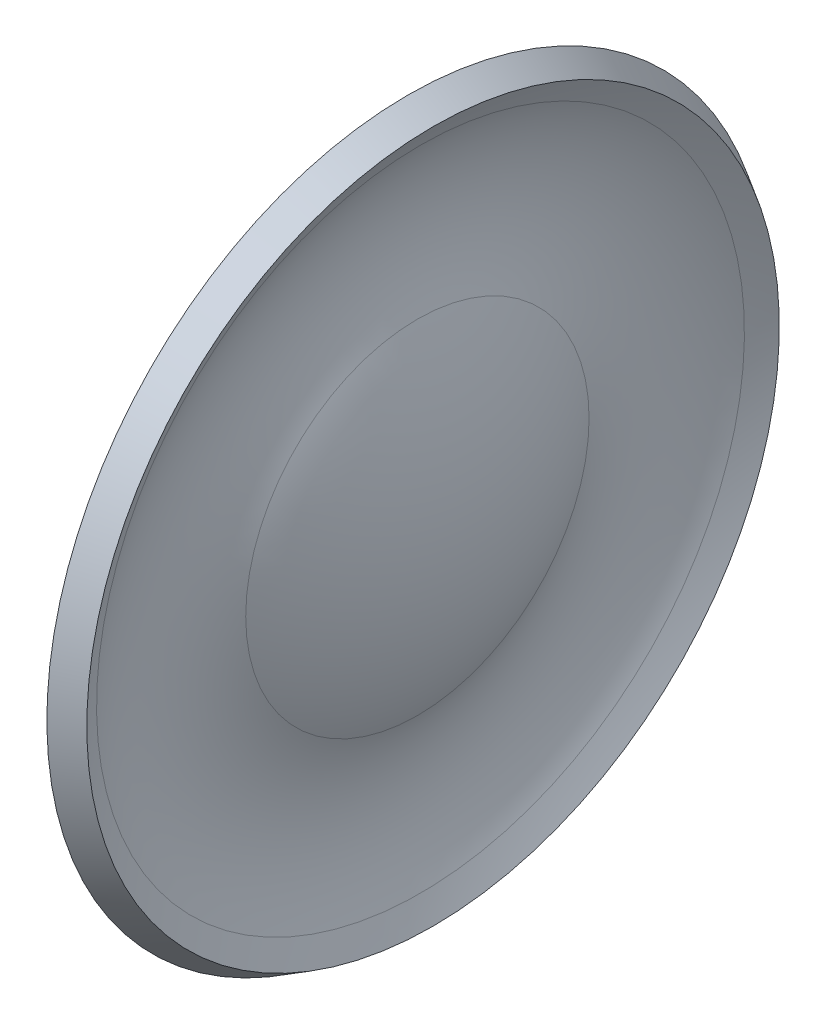
ISO-10303-21;
HEADER;
FILE_DESCRIPTION(('STEP AP214'),'2;1');
FILE_NAME('part.step','',(''),(''),'','','');
FILE_SCHEMA(('AUTOMOTIVE_DESIGN { 1 0 10303 214 1 1 1 1 }'));
ENDSEC;
DATA;
#1=APPLICATION_CONTEXT('core data for automotive mechanical design processes');
#2=APPLICATION_PROTOCOL_DEFINITION('international standard','automotive_design',2000,#1);
#3=PRODUCT_CONTEXT('',#1,'mechanical');
#4=PRODUCT('Part','Part','',(#3));
#5=PRODUCT_RELATED_PRODUCT_CATEGORY('part','',(#4));
#6=PRODUCT_DEFINITION_FORMATION('','',#4);
#7=PRODUCT_DEFINITION_CONTEXT('part definition',#1,'design');
#8=PRODUCT_DEFINITION('design','',#6,#7);
#9=PRODUCT_DEFINITION_SHAPE('','',#8);
#10=(LENGTH_UNIT() NAMED_UNIT(*) SI_UNIT(.MILLI.,.METRE.));
#11=(NAMED_UNIT(*) PLANE_ANGLE_UNIT() SI_UNIT($,.RADIAN.));
#12=(NAMED_UNIT(*) SI_UNIT($,.STERADIAN.) SOLID_ANGLE_UNIT());
#13=UNCERTAINTY_MEASURE_WITH_UNIT(LENGTH_MEASURE(1.E-05),#10,'distance_accuracy_value','');
#14=(GEOMETRIC_REPRESENTATION_CONTEXT(3) GLOBAL_UNCERTAINTY_ASSIGNED_CONTEXT((#13)) GLOBAL_UNIT_ASSIGNED_CONTEXT((#10,
#11,#12)) REPRESENTATION_CONTEXT('',''));
#15=CARTESIAN_POINT('',(0.,0.,0.));
#16=DIRECTION('',(0.,0.,1.));
#17=DIRECTION('',(1.,0.,0.));
#18=AXIS2_PLACEMENT_3D('',#15,#16,#17);
#19=CARTESIAN_POINT('',(0.,0.,0.));
#20=DIRECTION('',(1.,0.,0.));
#21=DIRECTION('',(0.,1.,0.));
#22=AXIS2_PLACEMENT_3D('',#19,#20,#21);
#23=SPHERICAL_SURFACE('',#22,7.1374);
#24=CARTESIAN_POINT('',(-6.15278434973676,0.,0.));
#25=DIRECTION('',(1.,0.,0.));
#26=DIRECTION('',(0.,1.,0.));
#27=AXIS2_PLACEMENT_3D('',#24,#25,#26);
#28=CIRCLE('',#27,3.61741945392491);
#29=CARTESIAN_POINT('',(-6.15278434973676,3.61741945392491,0.));
#30=VERTEX_POINT('',#29);
#31=EDGE_CURVE('E10',#30,#30,#28,.T.);
#32=ORIENTED_EDGE('',*,*,#31,.T.);
#33=EDGE_LOOP('',(#32));
#34=FACE_BOUND('',#33,.T.);
#35=CARTESIAN_POINT('',(-6.28404013660585,0.,0.));
#36=DIRECTION('',(1.,0.,0.));
#37=DIRECTION('',(0.,1.,0.));
#38=AXIS2_PLACEMENT_3D('',#35,#36,#37);
#39=CIRCLE('',#38,3.38427515452375);
#40=CARTESIAN_POINT('',(-6.28404013660585,3.38427515452375,0.));
#41=VERTEX_POINT('',#40);
#42=EDGE_CURVE('E50',#41,#41,#39,.T.);
#43=ORIENTED_EDGE('',*,*,#42,.F.);
#44=EDGE_LOOP('',(#43));
#45=FACE_BOUND('',#44,.T.);
#46=ADVANCED_FACE('F28',(#34,#45),#23,.F.);
#47=CARTESIAN_POINT('',(-6.15278434973676,0.,0.));
#48=DIRECTION('',(-1.,0.,0.));
#49=DIRECTION('',(0.,-1.,0.));
#50=AXIS2_PLACEMENT_3D('',#47,#48,#49);
#51=CONICAL_SURFACE('',#50,3.61741945392491,0.531498788891446);
#52=CARTESIAN_POINT('',(-6.41553670630915,0.,0.));
#53=DIRECTION('',(1.,0.,0.));
#54=DIRECTION('',(0.,1.,0.));
#55=AXIS2_PLACEMENT_3D('',#52,#53,#54);
#56=CIRCLE('',#55,3.7719);
#57=CARTESIAN_POINT('',(-6.41553670630915,3.7719,0.));
#58=VERTEX_POINT('',#57);
#59=EDGE_CURVE('E34',#58,#58,#56,.T.);
#60=ORIENTED_EDGE('',*,*,#59,.T.);
#61=EDGE_LOOP('',(#60));
#62=FACE_BOUND('',#61,.T.);
#63=ORIENTED_EDGE('',*,*,#31,.F.);
#64=EDGE_LOOP('',(#63));
#65=FACE_BOUND('',#64,.T.);
#66=ADVANCED_FACE('F58',(#62,#65),#51,.T.);
#67=CARTESIAN_POINT('',(0.,0.,0.));
#68=DIRECTION('',(1.,0.,0.));
#69=DIRECTION('',(0.,1.,0.));
#70=AXIS2_PLACEMENT_3D('',#67,#68,#69);
#71=SPHERICAL_SURFACE('',#70,7.4422);
#72=CARTESIAN_POINT('',(-6.55239772251073,0.,0.));
#73=DIRECTION('',(1.,0.,0.));
#74=DIRECTION('',(0.,1.,0.));
#75=AXIS2_PLACEMENT_3D('',#72,#73,#74);
#76=CIRCLE('',#75,3.52879936041088);
#77=CARTESIAN_POINT('',(-6.55239772251073,3.52879936041088,0.));
#78=VERTEX_POINT('',#77);
#79=EDGE_CURVE('E38',#78,#78,#76,.T.);
#80=ORIENTED_EDGE('',*,*,#79,.T.);
#81=EDGE_LOOP('',(#80));
#82=FACE_BOUND('',#81,.T.);
#83=ORIENTED_EDGE('',*,*,#59,.F.);
#84=EDGE_LOOP('',(#83));
#85=FACE_BOUND('',#84,.T.);
#86=ADVANCED_FACE('F62',(#82,#85),#71,.T.);
#87=CARTESIAN_POINT('',(-4.74893729581936,0.,0.));
#88=DIRECTION('',(1.,0.,0.));
#89=DIRECTION('',(0.,1.,0.));
#90=AXIS2_PLACEMENT_3D('',#87,#88,#89);
#91=TOROIDAL_SURFACE('',#90,2.55754421538646,2.04836668284226);
#92=CARTESIAN_POINT('',(-6.59026589485578,0.,0.));
#93=DIRECTION('',(1.,0.,0.));
#94=DIRECTION('',(0.,1.,0.));
#95=AXIS2_PLACEMENT_3D('',#92,#93,#94);
#96=CIRCLE('',#95,1.66015073549664);
#97=CARTESIAN_POINT('',(-6.59026589485578,1.66015073549664,0.));
#98=VERTEX_POINT('',#97);
#99=EDGE_CURVE('E42',#98,#98,#96,.T.);
#100=ORIENTED_EDGE('',*,*,#99,.T.);
#101=EDGE_LOOP('',(#100));
#102=FACE_BOUND('',#101,.T.);
#103=ORIENTED_EDGE('',*,*,#79,.F.);
#104=EDGE_LOOP('',(#103));
#105=FACE_BOUND('',#104,.T.);
#106=ADVANCED_FACE('F66',(#102,#105),#91,.T.);
#107=CARTESIAN_POINT('',(-9.99666798767753,0.,0.));
#108=DIRECTION('',(1.,0.,0.));
#109=DIRECTION('',(0.,1.,0.));
#110=AXIS2_PLACEMENT_3D('',#107,#108,#109);
#111=SPHERICAL_SURFACE('',#110,3.78941627200686);
#112=ORIENTED_EDGE('',*,*,#99,.F.);
#113=EDGE_LOOP('',(#112));
#114=FACE_BOUND('',#113,.T.);
#115=ADVANCED_FACE('F73',(#114),#111,.F.);
#116=CARTESIAN_POINT('',(-9.99666798767753,0.,0.));
#117=DIRECTION('',(1.,0.,0.));
#118=DIRECTION('',(0.,1.,0.));
#119=AXIS2_PLACEMENT_3D('',#116,#117,#118);
#120=SPHERICAL_SURFACE('',#119,4.09421627200686);
#121=CARTESIAN_POINT('',(-6.31627346874995,0.,0.));
#122=DIRECTION('',(1.,0.,0.));
#123=DIRECTION('',(0.,1.,0.));
#124=AXIS2_PLACEMENT_3D('',#121,#122,#123);
#125=CIRCLE('',#124,1.79368421607975);
#126=CARTESIAN_POINT('',(-6.31627346874995,1.79368421607975,0.));
#127=VERTEX_POINT('',#126);
#128=EDGE_CURVE('E47',#127,#127,#125,.T.);
#129=ORIENTED_EDGE('',*,*,#128,.T.);
#130=EDGE_LOOP('',(#129));
#131=FACE_BOUND('',#130,.T.);
#132=ADVANCED_FACE('F77',(#131),#120,.T.);
#133=CARTESIAN_POINT('',(-4.74893729581936,0.,0.));
#134=DIRECTION('',(1.,0.,0.));
#135=DIRECTION('',(0.,1.,0.));
#136=AXIS2_PLACEMENT_3D('',#133,#134,#135);
#137=TOROIDAL_SURFACE('',#136,2.55754421538646,1.74356668284226);
#138=ORIENTED_EDGE('',*,*,#42,.T.);
#139=EDGE_LOOP('',(#138));
#140=FACE_BOUND('',#139,.T.);
#141=ORIENTED_EDGE('',*,*,#128,.F.);
#142=EDGE_LOOP('',(#141));
#143=FACE_BOUND('',#142,.T.);
#144=ADVANCED_FACE('F54',(#140,#143),#137,.F.);
#145=CLOSED_SHELL('',(#46,#66,#86,#106,#115,#132,#144));
#146=MANIFOLD_SOLID_BREP('B2',#145);
#147=ADVANCED_BREP_SHAPE_REPRESENTATION('',(#18,#146),#14);
#148=SHAPE_DEFINITION_REPRESENTATION(#9,#147);
ENDSEC;
END-ISO-10303-21;
